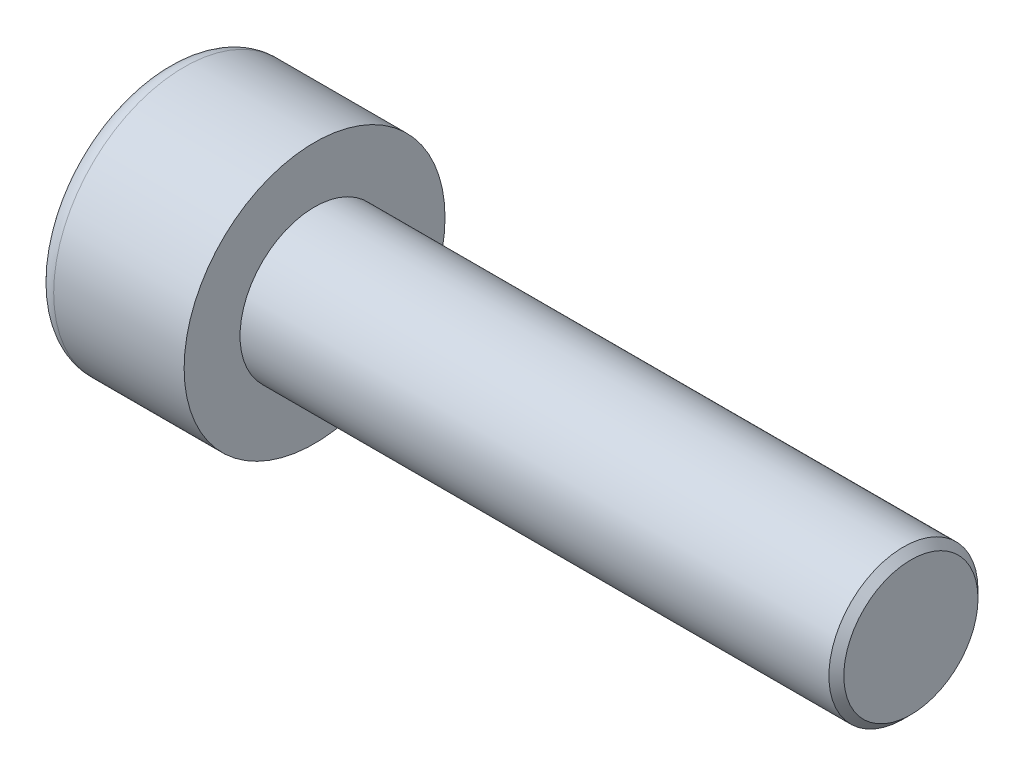
ISO-10303-21;
HEADER;
FILE_DESCRIPTION(('STEP AP214'),'2;1');
FILE_NAME('part.step','',(''),(''),'','','');
FILE_SCHEMA(('AUTOMOTIVE_DESIGN { 1 0 10303 214 1 1 1 1 }'));
ENDSEC;
DATA;
#1=APPLICATION_CONTEXT('core data for automotive mechanical design processes');
#2=APPLICATION_PROTOCOL_DEFINITION('international standard','automotive_design',2000,#1);
#3=PRODUCT_CONTEXT('',#1,'mechanical');
#4=PRODUCT('Part','Part','',(#3));
#5=PRODUCT_RELATED_PRODUCT_CATEGORY('part','',(#4));
#6=PRODUCT_DEFINITION_FORMATION('','',#4);
#7=PRODUCT_DEFINITION_CONTEXT('part definition',#1,'design');
#8=PRODUCT_DEFINITION('design','',#6,#7);
#9=PRODUCT_DEFINITION_SHAPE('','',#8);
#10=(LENGTH_UNIT() NAMED_UNIT(*) SI_UNIT(.MILLI.,.METRE.));
#11=(NAMED_UNIT(*) PLANE_ANGLE_UNIT() SI_UNIT($,.RADIAN.));
#12=(NAMED_UNIT(*) SI_UNIT($,.STERADIAN.) SOLID_ANGLE_UNIT());
#13=UNCERTAINTY_MEASURE_WITH_UNIT(LENGTH_MEASURE(1.E-05),#10,'distance_accuracy_value','');
#14=(GEOMETRIC_REPRESENTATION_CONTEXT(3) GLOBAL_UNCERTAINTY_ASSIGNED_CONTEXT((#13)) GLOBAL_UNIT_ASSIGNED_CONTEXT((#10,
#11,#12)) REPRESENTATION_CONTEXT('',''));
#15=CARTESIAN_POINT('',(0.,0.,0.));
#16=DIRECTION('',(0.,0.,1.));
#17=DIRECTION('',(1.,0.,0.));
#18=AXIS2_PLACEMENT_3D('',#15,#16,#17);
#19=CARTESIAN_POINT('',(2.,1.5,-2.59807621135331));
#20=DIRECTION('',(1.,0.,0.));
#21=DIRECTION('',(0.,0.,-1.));
#22=AXIS2_PLACEMENT_3D('',#19,#20,#21);
#23=PLANE('',#22);
#24=CARTESIAN_POINT('',(2.,0.,0.));
#25=DIRECTION('',(1.,0.,0.));
#26=DIRECTION('',(0.,0.,-1.));
#27=AXIS2_PLACEMENT_3D('',#24,#25,#26);
#28=CIRCLE('',#27,1.5);
#29=CARTESIAN_POINT('',(2.,-0.75,-1.29903810567666));
#30=VERTEX_POINT('',#29);
#31=CARTESIAN_POINT('',(2.,-1.5,0.));
#32=VERTEX_POINT('',#31);
#33=EDGE_CURVE('E195',#30,#32,#28,.F.);
#34=ORIENTED_EDGE('',*,*,#33,.F.);
#35=DIRECTION('',(0.,0.866025403784439,-0.5));
#36=VECTOR('',#35,1.);
#37=CARTESIAN_POINT('',(2.,-1.5,-0.866025403784437));
#38=LINE('',#37,#36);
#39=CARTESIAN_POINT('',(2.,-1.5,-0.866025403784437));
#40=VERTEX_POINT('',#39);
#41=EDGE_CURVE('E383',#40,#30,#38,.T.);
#42=ORIENTED_EDGE('',*,*,#41,.F.);
#43=DIRECTION('',(0.,0.,-1.));
#44=VECTOR('',#43,1.);
#45=CARTESIAN_POINT('',(2.,-1.5,0.86602540378444));
#46=LINE('',#45,#44);
#47=EDGE_CURVE('E345',#32,#40,#46,.T.);
#48=ORIENTED_EDGE('',*,*,#47,.F.);
#49=EDGE_LOOP('',(#34,#42,#48));
#50=FACE_BOUND('',#49,.T.);
#51=ADVANCED_FACE('F38',(#50),#23,.F.);
#52=CARTESIAN_POINT('',(2.,-0.75,1.29903810567666));
#53=VERTEX_POINT('',#52);
#54=EDGE_CURVE('E332',#32,#53,#28,.F.);
#55=ORIENTED_EDGE('',*,*,#54,.F.);
#56=CARTESIAN_POINT('',(2.,-1.5,0.86602540378444));
#57=VERTEX_POINT('',#56);
#58=EDGE_CURVE('E338',#57,#32,#46,.T.);
#59=ORIENTED_EDGE('',*,*,#58,.F.);
#60=DIRECTION('',(0.,-0.866025403784438,-0.5));
#61=VECTOR('',#60,1.);
#62=CARTESIAN_POINT('',(2.,0.,1.73205080756888));
#63=LINE('',#62,#61);
#64=EDGE_CURVE('E335',#53,#57,#63,.T.);
#65=ORIENTED_EDGE('',*,*,#64,.F.);
#66=EDGE_LOOP('',(#55,#59,#65));
#67=FACE_BOUND('',#66,.T.);
#68=ADVANCED_FACE('F127',(#67),#23,.F.);
#69=CARTESIAN_POINT('',(2.,0.75,1.29903810567666));
#70=VERTEX_POINT('',#69);
#71=EDGE_CURVE('E325',#53,#70,#28,.F.);
#72=ORIENTED_EDGE('',*,*,#71,.F.);
#73=CARTESIAN_POINT('',(2.,0.,1.73205080756888));
#74=VERTEX_POINT('',#73);
#75=EDGE_CURVE('E328',#74,#53,#63,.T.);
#76=ORIENTED_EDGE('',*,*,#75,.F.);
#77=DIRECTION('',(0.,-0.866025403784438,0.5));
#78=VECTOR('',#77,1.);
#79=CARTESIAN_POINT('',(2.,1.5,0.86602540378444));
#80=LINE('',#79,#78);
#81=EDGE_CURVE('E329',#70,#74,#80,.T.);
#82=ORIENTED_EDGE('',*,*,#81,.F.);
#83=EDGE_LOOP('',(#72,#76,#82));
#84=FACE_BOUND('',#83,.T.);
#85=ADVANCED_FACE('F132',(#84),#23,.F.);
#86=CARTESIAN_POINT('',(2.,1.5,0.));
#87=VERTEX_POINT('',#86);
#88=EDGE_CURVE('E193',#70,#87,#28,.F.);
#89=ORIENTED_EDGE('',*,*,#88,.F.);
#90=CARTESIAN_POINT('',(2.,1.5,0.86602540378444));
#91=VERTEX_POINT('',#90);
#92=EDGE_CURVE('E340',#91,#70,#80,.T.);
#93=ORIENTED_EDGE('',*,*,#92,.F.);
#94=DIRECTION('',(0.,0.,1.));
#95=VECTOR('',#94,1.);
#96=CARTESIAN_POINT('',(2.,1.5,-0.866025403784437));
#97=LINE('',#96,#95);
#98=EDGE_CURVE('E389',#87,#91,#97,.T.);
#99=ORIENTED_EDGE('',*,*,#98,.F.);
#100=EDGE_LOOP('',(#89,#93,#99));
#101=FACE_BOUND('',#100,.T.);
#102=ADVANCED_FACE('F282',(#101),#23,.F.);
#103=CARTESIAN_POINT('',(2.,0.,0.));
#104=DIRECTION('',(1.,0.,0.));
#105=DIRECTION('',(0.,0.,-1.));
#106=AXIS2_PLACEMENT_3D('',#103,#104,#105);
#107=CIRCLE('',#106,1.5);
#108=CARTESIAN_POINT('',(2.,0.749999999999999,-1.29903810567666));
#109=VERTEX_POINT('',#108);
#110=EDGE_CURVE('E53',#109,#87,#107,.T.);
#111=ORIENTED_EDGE('',*,*,#110,.T.);
#112=CARTESIAN_POINT('',(2.,1.5,-0.866025403784437));
#113=VERTEX_POINT('',#112);
#114=EDGE_CURVE('E390',#113,#87,#97,.T.);
#115=ORIENTED_EDGE('',*,*,#114,.F.);
#116=DIRECTION('',(0.,0.866025403784438,0.5));
#117=VECTOR('',#116,1.);
#118=CARTESIAN_POINT('',(2.,0.,-1.73205080756888));
#119=LINE('',#118,#117);
#120=EDGE_CURVE('E384',#109,#113,#119,.T.);
#121=ORIENTED_EDGE('',*,*,#120,.F.);
#122=EDGE_LOOP('',(#111,#115,#121));
#123=FACE_BOUND('',#122,.T.);
#124=ADVANCED_FACE('F125',(#123),#23,.F.);
#125=CARTESIAN_POINT('',(0.,0.,0.));
#126=DIRECTION('',(1.,0.,0.));
#127=DIRECTION('',(0.,0.,-1.));
#128=AXIS2_PLACEMENT_3D('',#125,#126,#127);
#129=PLANE('',#128);
#130=CARTESIAN_POINT('',(0.,0.,0.));
#131=DIRECTION('',(1.,0.,0.));
#132=DIRECTION('',(0.,0.,-1.));
#133=AXIS2_PLACEMENT_3D('',#130,#131,#132);
#134=CIRCLE('',#133,3.);
#135=CARTESIAN_POINT('',(0.,0.,-3.));
#136=VERTEX_POINT('',#135);
#137=EDGE_CURVE('E202',#136,#136,#134,.F.);
#138=ORIENTED_EDGE('',*,*,#137,.T.);
#139=EDGE_LOOP('',(#138));
#140=FACE_BOUND('',#139,.T.);
#141=DIRECTION('',(0.,0.866025403784439,-0.5));
#142=VECTOR('',#141,1.);
#143=CARTESIAN_POINT('',(0.,-1.5,-0.866025403784437));
#144=LINE('',#143,#142);
#145=CARTESIAN_POINT('',(0.,-1.5,-0.866025403784437));
#146=VERTEX_POINT('',#145);
#147=CARTESIAN_POINT('',(0.,0.,-1.73205080756888));
#148=VERTEX_POINT('',#147);
#149=EDGE_CURVE('E61',#146,#148,#144,.T.);
#150=ORIENTED_EDGE('',*,*,#149,.T.);
#151=DIRECTION('',(0.,0.866025403784438,0.5));
#152=VECTOR('',#151,1.);
#153=CARTESIAN_POINT('',(0.,0.,-1.73205080756888));
#154=LINE('',#153,#152);
#155=CARTESIAN_POINT('',(0.,1.5,-0.866025403784437));
#156=VERTEX_POINT('',#155);
#157=EDGE_CURVE('E352',#148,#156,#154,.T.);
#158=ORIENTED_EDGE('',*,*,#157,.T.);
#159=DIRECTION('',(0.,0.,1.));
#160=VECTOR('',#159,1.);
#161=CARTESIAN_POINT('',(0.,1.5,-0.866025403784437));
#162=LINE('',#161,#160);
#163=CARTESIAN_POINT('',(0.,1.5,0.86602540378444));
#164=VERTEX_POINT('',#163);
#165=EDGE_CURVE('E355',#156,#164,#162,.T.);
#166=ORIENTED_EDGE('',*,*,#165,.T.);
#167=DIRECTION('',(0.,-0.866025403784438,0.5));
#168=VECTOR('',#167,1.);
#169=CARTESIAN_POINT('',(0.,1.5,0.86602540378444));
#170=LINE('',#169,#168);
#171=CARTESIAN_POINT('',(0.,0.,1.73205080756888));
#172=VERTEX_POINT('',#171);
#173=EDGE_CURVE('E358',#164,#172,#170,.T.);
#174=ORIENTED_EDGE('',*,*,#173,.T.);
#175=DIRECTION('',(0.,-0.866025403784438,-0.5));
#176=VECTOR('',#175,1.);
#177=CARTESIAN_POINT('',(0.,0.,1.73205080756888));
#178=LINE('',#177,#176);
#179=CARTESIAN_POINT('',(0.,-1.5,0.86602540378444));
#180=VERTEX_POINT('',#179);
#181=EDGE_CURVE('E361',#172,#180,#178,.T.);
#182=ORIENTED_EDGE('',*,*,#181,.T.);
#183=DIRECTION('',(0.,0.,-1.));
#184=VECTOR('',#183,1.);
#185=CARTESIAN_POINT('',(0.,-1.5,0.86602540378444));
#186=LINE('',#185,#184);
#187=EDGE_CURVE('E364',#180,#146,#186,.T.);
#188=ORIENTED_EDGE('',*,*,#187,.T.);
#189=EDGE_LOOP('',(#150,#158,#166,#174,#182,#188));
#190=FACE_BOUND('',#189,.T.);
#191=ADVANCED_FACE('F171',(#140,#190),#129,.F.);
#192=CARTESIAN_POINT('',(4.,0.,0.));
#193=DIRECTION('',(-1.,0.,0.));
#194=DIRECTION('',(0.,0.,1.));
#195=AXIS2_PLACEMENT_3D('',#192,#193,#194);
#196=CYLINDRICAL_SURFACE('',#195,3.5);
#197=CARTESIAN_POINT('',(0.5,0.,0.));
#198=DIRECTION('',(1.,0.,0.));
#199=DIRECTION('',(0.,0.,-1.));
#200=AXIS2_PLACEMENT_3D('',#197,#198,#199);
#201=CIRCLE('',#200,3.5);
#202=CARTESIAN_POINT('',(0.5,0.,-3.5));
#203=VERTEX_POINT('',#202);
#204=EDGE_CURVE('E182',#203,#203,#201,.T.);
#205=ORIENTED_EDGE('',*,*,#204,.T.);
#206=EDGE_LOOP('',(#205));
#207=FACE_BOUND('',#206,.T.);
#208=CARTESIAN_POINT('',(4.,0.,0.));
#209=DIRECTION('',(1.,0.,0.));
#210=DIRECTION('',(0.,0.,-1.));
#211=AXIS2_PLACEMENT_3D('',#208,#209,#210);
#212=CIRCLE('',#211,3.5);
#213=CARTESIAN_POINT('',(4.,0.,-3.5));
#214=VERTEX_POINT('',#213);
#215=EDGE_CURVE('E185',#214,#214,#212,.T.);
#216=ORIENTED_EDGE('',*,*,#215,.F.);
#217=EDGE_LOOP('',(#216));
#218=FACE_BOUND('',#217,.T.);
#219=ADVANCED_FACE('F169',(#207,#218),#196,.T.);
#220=CARTESIAN_POINT('',(4.,0.,0.));
#221=DIRECTION('',(1.,0.,0.));
#222=DIRECTION('',(0.,0.,-1.));
#223=AXIS2_PLACEMENT_3D('',#220,#221,#222);
#224=PLANE('',#223);
#225=CARTESIAN_POINT('',(4.,0.,0.));
#226=DIRECTION('',(1.,0.,0.));
#227=DIRECTION('',(0.,0.,-1.));
#228=AXIS2_PLACEMENT_3D('',#225,#226,#227);
#229=CIRCLE('',#228,2.);
#230=CARTESIAN_POINT('',(4.,0.,-2.));
#231=VERTEX_POINT('',#230);
#232=EDGE_CURVE('E189',#231,#231,#229,.T.);
#233=ORIENTED_EDGE('',*,*,#232,.F.);
#234=EDGE_LOOP('',(#233));
#235=FACE_BOUND('',#234,.T.);
#236=ORIENTED_EDGE('',*,*,#215,.T.);
#237=EDGE_LOOP('',(#236));
#238=FACE_BOUND('',#237,.T.);
#239=ADVANCED_FACE('F165',(#235,#238),#224,.T.);
#240=CARTESIAN_POINT('',(20.,0.,0.));
#241=DIRECTION('',(-1.,0.,0.));
#242=DIRECTION('',(0.,0.,1.));
#243=AXIS2_PLACEMENT_3D('',#240,#241,#242);
#244=CYLINDRICAL_SURFACE('',#243,2.);
#245=CARTESIAN_POINT('',(19.8,0.,0.));
#246=DIRECTION('',(1.,0.,0.));
#247=DIRECTION('',(0.,0.,-1.));
#248=AXIS2_PLACEMENT_3D('',#245,#246,#247);
#249=CIRCLE('',#248,2.);
#250=CARTESIAN_POINT('',(19.8,0.,-2.));
#251=VERTEX_POINT('',#250);
#252=EDGE_CURVE('E11',#251,#251,#249,.F.);
#253=ORIENTED_EDGE('',*,*,#252,.T.);
#254=EDGE_LOOP('',(#253));
#255=FACE_BOUND('',#254,.T.);
#256=ORIENTED_EDGE('',*,*,#232,.T.);
#257=EDGE_LOOP('',(#256));
#258=FACE_BOUND('',#257,.T.);
#259=ADVANCED_FACE('F161',(#255,#258),#244,.T.);
#260=CARTESIAN_POINT('',(20.,0.,0.));
#261=DIRECTION('',(1.,0.,0.));
#262=DIRECTION('',(0.,0.,-1.));
#263=AXIS2_PLACEMENT_3D('',#260,#261,#262);
#264=PLANE('',#263);
#265=CARTESIAN_POINT('',(20.,0.,0.));
#266=DIRECTION('',(1.,0.,0.));
#267=DIRECTION('',(0.,0.,-1.));
#268=AXIS2_PLACEMENT_3D('',#265,#266,#267);
#269=CIRCLE('',#268,1.8);
#270=CARTESIAN_POINT('',(20.,0.,-1.8));
#271=VERTEX_POINT('',#270);
#272=EDGE_CURVE('E46',#271,#271,#269,.T.);
#273=ORIENTED_EDGE('',*,*,#272,.T.);
#274=EDGE_LOOP('',(#273));
#275=FACE_BOUND('',#274,.T.);
#276=ADVANCED_FACE('F158',(#275),#264,.T.);
#277=CARTESIAN_POINT('',(2.,-1.5,-0.866025403784437));
#278=DIRECTION('',(0.,0.5,0.866025403784439));
#279=DIRECTION('',(0.,-0.866025403784439,0.5));
#280=AXIS2_PLACEMENT_3D('',#277,#278,#279);
#281=PLANE('',#280);
#282=ORIENTED_EDGE('',*,*,#149,.F.);
#283=DIRECTION('',(-1.,0.,0.));
#284=VECTOR('',#283,1.);
#285=CARTESIAN_POINT('',(2.,-1.5,-0.866025403784437));
#286=LINE('',#285,#284);
#287=EDGE_CURVE('E350',#40,#146,#286,.T.);
#288=ORIENTED_EDGE('',*,*,#287,.F.);
#289=ORIENTED_EDGE('',*,*,#41,.T.);
#290=CARTESIAN_POINT('',(2.,0.,-1.73205080756888));
#291=VERTEX_POINT('',#290);
#292=EDGE_CURVE('E367',#30,#291,#38,.T.);
#293=ORIENTED_EDGE('',*,*,#292,.T.);
#294=DIRECTION('',(-1.,0.,0.));
#295=VECTOR('',#294,1.);
#296=CARTESIAN_POINT('',(2.,0.,-1.73205080756888));
#297=LINE('',#296,#295);
#298=EDGE_CURVE('E197',#291,#148,#297,.T.);
#299=ORIENTED_EDGE('',*,*,#298,.T.);
#300=EDGE_LOOP('',(#282,#288,#289,#293,#299));
#301=FACE_BOUND('',#300,.T.);
#302=ADVANCED_FACE('F154',(#301),#281,.T.);
#303=CARTESIAN_POINT('',(2.,0.,-1.73205080756888));
#304=DIRECTION('',(0.,-0.5,0.866025403784439));
#305=DIRECTION('',(0.,-0.866025403784438,-0.5));
#306=AXIS2_PLACEMENT_3D('',#303,#304,#305);
#307=PLANE('',#306);
#308=ORIENTED_EDGE('',*,*,#157,.F.);
#309=ORIENTED_EDGE('',*,*,#298,.F.);
#310=EDGE_CURVE('E386',#291,#109,#119,.T.);
#311=ORIENTED_EDGE('',*,*,#310,.T.);
#312=ORIENTED_EDGE('',*,*,#120,.T.);
#313=DIRECTION('',(-1.,0.,0.));
#314=VECTOR('',#313,1.);
#315=CARTESIAN_POINT('',(2.,1.5,-0.866025403784437));
#316=LINE('',#315,#314);
#317=EDGE_CURVE('E374',#113,#156,#316,.T.);
#318=ORIENTED_EDGE('',*,*,#317,.T.);
#319=EDGE_LOOP('',(#308,#309,#311,#312,#318));
#320=FACE_BOUND('',#319,.T.);
#321=ADVANCED_FACE('F150',(#320),#307,.T.);
#322=CARTESIAN_POINT('',(2.,1.5,-0.866025403784437));
#323=DIRECTION('',(0.,-1.,0.));
#324=DIRECTION('',(0.,0.,-1.));
#325=AXIS2_PLACEMENT_3D('',#322,#323,#324);
#326=PLANE('',#325);
#327=ORIENTED_EDGE('',*,*,#165,.F.);
#328=ORIENTED_EDGE('',*,*,#317,.F.);
#329=ORIENTED_EDGE('',*,*,#114,.T.);
#330=ORIENTED_EDGE('',*,*,#98,.T.);
#331=DIRECTION('',(-1.,0.,0.));
#332=VECTOR('',#331,1.);
#333=CARTESIAN_POINT('',(2.,1.5,0.86602540378444));
#334=LINE('',#333,#332);
#335=EDGE_CURVE('E372',#91,#164,#334,.T.);
#336=ORIENTED_EDGE('',*,*,#335,.T.);
#337=EDGE_LOOP('',(#327,#328,#329,#330,#336));
#338=FACE_BOUND('',#337,.T.);
#339=ADVANCED_FACE('F146',(#338),#326,.T.);
#340=CARTESIAN_POINT('',(2.,1.5,0.86602540378444));
#341=DIRECTION('',(0.,-0.5,-0.866025403784439));
#342=DIRECTION('',(0.,0.866025403784439,-0.5));
#343=AXIS2_PLACEMENT_3D('',#340,#341,#342);
#344=PLANE('',#343);
#345=ORIENTED_EDGE('',*,*,#173,.F.);
#346=ORIENTED_EDGE('',*,*,#335,.F.);
#347=ORIENTED_EDGE('',*,*,#92,.T.);
#348=ORIENTED_EDGE('',*,*,#81,.T.);
#349=DIRECTION('',(-1.,0.,0.));
#350=VECTOR('',#349,1.);
#351=CARTESIAN_POINT('',(2.,0.,1.73205080756888));
#352=LINE('',#351,#350);
#353=EDGE_CURVE('E344',#74,#172,#352,.T.);
#354=ORIENTED_EDGE('',*,*,#353,.T.);
#355=EDGE_LOOP('',(#345,#346,#347,#348,#354));
#356=FACE_BOUND('',#355,.T.);
#357=ADVANCED_FACE('F142',(#356),#344,.T.);
#358=CARTESIAN_POINT('',(2.,0.,1.73205080756888));
#359=DIRECTION('',(0.,0.5,-0.866025403784439));
#360=DIRECTION('',(0.,0.866025403784438,0.5));
#361=AXIS2_PLACEMENT_3D('',#358,#359,#360);
#362=PLANE('',#361);
#363=ORIENTED_EDGE('',*,*,#181,.F.);
#364=ORIENTED_EDGE('',*,*,#353,.F.);
#365=ORIENTED_EDGE('',*,*,#75,.T.);
#366=ORIENTED_EDGE('',*,*,#64,.T.);
#367=DIRECTION('',(-1.,0.,0.));
#368=VECTOR('',#367,1.);
#369=CARTESIAN_POINT('',(2.,-1.5,0.86602540378444));
#370=LINE('',#369,#368);
#371=EDGE_CURVE('E369',#57,#180,#370,.T.);
#372=ORIENTED_EDGE('',*,*,#371,.T.);
#373=EDGE_LOOP('',(#363,#364,#365,#366,#372));
#374=FACE_BOUND('',#373,.T.);
#375=ADVANCED_FACE('F138',(#374),#362,.T.);
#376=CARTESIAN_POINT('',(2.,-1.5,0.86602540378444));
#377=DIRECTION('',(0.,1.,0.));
#378=DIRECTION('',(0.,0.,1.));
#379=AXIS2_PLACEMENT_3D('',#376,#377,#378);
#380=PLANE('',#379);
#381=ORIENTED_EDGE('',*,*,#187,.F.);
#382=ORIENTED_EDGE('',*,*,#371,.F.);
#383=ORIENTED_EDGE('',*,*,#58,.T.);
#384=ORIENTED_EDGE('',*,*,#47,.T.);
#385=ORIENTED_EDGE('',*,*,#287,.T.);
#386=EDGE_LOOP('',(#381,#382,#383,#384,#385));
#387=FACE_BOUND('',#386,.T.);
#388=ADVANCED_FACE('F122',(#387),#380,.T.);
#389=EDGE_CURVE('E188',#109,#30,#28,.F.);
#390=ORIENTED_EDGE('',*,*,#389,.F.);
#391=ORIENTED_EDGE('',*,*,#310,.F.);
#392=ORIENTED_EDGE('',*,*,#292,.F.);
#393=EDGE_LOOP('',(#390,#391,#392));
#394=FACE_BOUND('',#393,.T.);
#395=ADVANCED_FACE('F115',(#394),#23,.F.);
#396=CARTESIAN_POINT('',(2.,0.,0.));
#397=DIRECTION('',(-1.,0.,0.));
#398=DIRECTION('',(0.,0.,1.));
#399=AXIS2_PLACEMENT_3D('',#396,#397,#398);
#400=CONICAL_SURFACE('',#399,1.5,1.04719755119659);
#401=CARTESIAN_POINT('',(2.86602540378445,0.,0.));
#402=VERTEX_POINT('',#401);
#403=VERTEX_LOOP('',#402);
#404=FACE_BOUND('',#403,.T.);
#405=ORIENTED_EDGE('',*,*,#110,.F.);
#406=ORIENTED_EDGE('',*,*,#389,.T.);
#407=ORIENTED_EDGE('',*,*,#33,.T.);
#408=ORIENTED_EDGE('',*,*,#54,.T.);
#409=ORIENTED_EDGE('',*,*,#71,.T.);
#410=ORIENTED_EDGE('',*,*,#88,.T.);
#411=EDGE_LOOP('',(#405,#406,#407,#408,#409,#410));
#412=FACE_BOUND('',#411,.T.);
#413=ADVANCED_FACE('F112',(#404,#412),#400,.F.);
#414=CARTESIAN_POINT('',(0.5,0.,0.));
#415=DIRECTION('',(1.,0.,0.));
#416=DIRECTION('',(0.,0.,-1.));
#417=AXIS2_PLACEMENT_3D('',#414,#415,#416);
#418=TOROIDAL_SURFACE('',#417,3.,0.5);
#419=ORIENTED_EDGE('',*,*,#137,.F.);
#420=EDGE_LOOP('',(#419));
#421=FACE_BOUND('',#420,.T.);
#422=ORIENTED_EDGE('',*,*,#204,.F.);
#423=EDGE_LOOP('',(#422));
#424=FACE_BOUND('',#423,.T.);
#425=ADVANCED_FACE('F114',(#421,#424),#418,.T.);
#426=CARTESIAN_POINT('',(20.,0.,0.));
#427=DIRECTION('',(-1.,0.,0.));
#428=DIRECTION('',(0.,0.,1.));
#429=AXIS2_PLACEMENT_3D('',#426,#427,#428);
#430=CONICAL_SURFACE('',#429,1.8,0.785398163397444);
#431=ORIENTED_EDGE('',*,*,#252,.F.);
#432=EDGE_LOOP('',(#431));
#433=FACE_BOUND('',#432,.T.);
#434=ORIENTED_EDGE('',*,*,#272,.F.);
#435=EDGE_LOOP('',(#434));
#436=FACE_BOUND('',#435,.T.);
#437=ADVANCED_FACE('F40',(#433,#436),#430,.T.);
#438=CLOSED_SHELL('',(#51,#68,#85,#102,#124,#191,#219,#239,#259,#276,#302,#321,#339,#357,#375,
#388,#395,#413,#425,#437));
#439=MANIFOLD_SOLID_BREP('B2',#438);
#440=ADVANCED_BREP_SHAPE_REPRESENTATION('',(#18,#439),#14);
#441=SHAPE_DEFINITION_REPRESENTATION(#9,#440);
ENDSEC;
END-ISO-10303-21;
